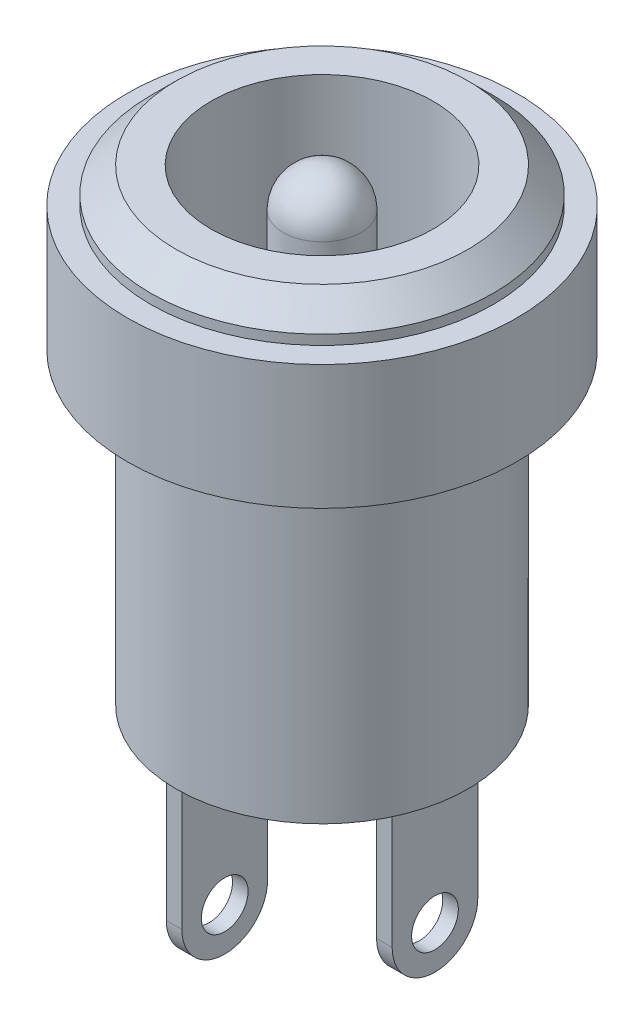
ISO-10303-21;
HEADER;
FILE_DESCRIPTION(('STEP AP214'),'2;1');
FILE_NAME('part.step','',(''),(''),'','','');
FILE_SCHEMA(('AUTOMOTIVE_DESIGN { 1 0 10303 214 1 1 1 1 }'));
ENDSEC;
DATA;
#1=APPLICATION_CONTEXT('core data for automotive mechanical design processes');
#2=APPLICATION_PROTOCOL_DEFINITION('international standard','automotive_design',2000,#1);
#3=PRODUCT_CONTEXT('',#1,'mechanical');
#4=PRODUCT('Part','Part','',(#3));
#5=PRODUCT_RELATED_PRODUCT_CATEGORY('part','',(#4));
#6=PRODUCT_DEFINITION_FORMATION('','',#4);
#7=PRODUCT_DEFINITION_CONTEXT('part definition',#1,'design');
#8=PRODUCT_DEFINITION('design','',#6,#7);
#9=PRODUCT_DEFINITION_SHAPE('','',#8);
#10=(LENGTH_UNIT() NAMED_UNIT(*) SI_UNIT(.MILLI.,.METRE.));
#11=(NAMED_UNIT(*) PLANE_ANGLE_UNIT() SI_UNIT($,.RADIAN.));
#12=(NAMED_UNIT(*) SI_UNIT($,.STERADIAN.) SOLID_ANGLE_UNIT());
#13=UNCERTAINTY_MEASURE_WITH_UNIT(LENGTH_MEASURE(1.E-05),#10,'distance_accuracy_value','');
#14=(GEOMETRIC_REPRESENTATION_CONTEXT(3) GLOBAL_UNCERTAINTY_ASSIGNED_CONTEXT((#13)) GLOBAL_UNIT_ASSIGNED_CONTEXT((#10,
#11,#12)) REPRESENTATION_CONTEXT('',''));
#15=CARTESIAN_POINT('',(0.,0.,0.));
#16=DIRECTION('',(0.,0.,1.));
#17=DIRECTION('',(1.,0.,0.));
#18=AXIS2_PLACEMENT_3D('',#15,#16,#17);
#19=CARTESIAN_POINT('',(-2.5,-12.8,1.1));
#20=DIRECTION('',(-1.,0.,0.));
#21=DIRECTION('',(0.,0.,1.));
#22=AXIS2_PLACEMENT_3D('',#19,#20,#21);
#23=PLANE('',#22);
#24=CARTESIAN_POINT('',(-2.5,-11.7,0.));
#25=DIRECTION('',(-1.,0.,0.));
#26=DIRECTION('',(0.,0.,1.));
#27=AXIS2_PLACEMENT_3D('',#24,#25,#26);
#28=CIRCLE('',#27,0.6);
#29=CARTESIAN_POINT('',(-2.5,-11.7,0.600000000000001));
#30=VERTEX_POINT('',#29);
#31=EDGE_CURVE('E611',#30,#30,#28,.F.);
#32=ORIENTED_EDGE('',*,*,#31,.F.);
#33=EDGE_LOOP('',(#32));
#34=FACE_BOUND('',#33,.T.);
#35=CARTESIAN_POINT('',(-2.5,-11.7,0.));
#36=DIRECTION('',(-1.,0.,0.));
#37=DIRECTION('',(0.,0.,1.));
#38=AXIS2_PLACEMENT_3D('',#35,#36,#37);
#39=CIRCLE('',#38,1.1);
#40=CARTESIAN_POINT('',(-2.5,-11.7,1.1));
#41=VERTEX_POINT('',#40);
#42=CARTESIAN_POINT('',(-2.5,-11.7,-1.1));
#43=VERTEX_POINT('',#42);
#44=EDGE_CURVE('E172',#41,#43,#39,.F.);
#45=ORIENTED_EDGE('',*,*,#44,.T.);
#46=DIRECTION('',(0.,1.,0.));
#47=VECTOR('',#46,1.);
#48=CARTESIAN_POINT('',(-2.5,-12.8,-1.1));
#49=LINE('',#48,#47);
#50=CARTESIAN_POINT('',(-2.5,-6.,-1.1));
#51=VERTEX_POINT('',#50);
#52=EDGE_CURVE('E179',#43,#51,#49,.T.);
#53=ORIENTED_EDGE('',*,*,#52,.T.);
#54=DIRECTION('',(0.,0.,1.));
#55=VECTOR('',#54,1.);
#56=CARTESIAN_POINT('',(-2.5,-6.,1.1));
#57=LINE('',#56,#55);
#58=CARTESIAN_POINT('',(-2.5,-6.,1.1));
#59=VERTEX_POINT('',#58);
#60=EDGE_CURVE('E248',#51,#59,#57,.T.);
#61=ORIENTED_EDGE('',*,*,#60,.T.);
#62=DIRECTION('',(0.,1.,0.));
#63=VECTOR('',#62,1.);
#64=CARTESIAN_POINT('',(-2.5,-12.8,1.1));
#65=LINE('',#64,#63);
#66=EDGE_CURVE('E188',#41,#59,#65,.T.);
#67=ORIENTED_EDGE('',*,*,#66,.F.);
#68=EDGE_LOOP('',(#45,#53,#61,#67));
#69=FACE_BOUND('',#68,.T.);
#70=ADVANCED_FACE('F96',(#34,#69),#23,.F.);
#71=CARTESIAN_POINT('',(-2.9,-12.8,1.1));
#72=DIRECTION('',(1.,0.,0.));
#73=DIRECTION('',(0.,0.,-1.));
#74=AXIS2_PLACEMENT_3D('',#71,#72,#73);
#75=PLANE('',#74);
#76=CARTESIAN_POINT('',(-2.9,-11.7,0.));
#77=DIRECTION('',(-1.,0.,0.));
#78=DIRECTION('',(0.,0.,1.));
#79=AXIS2_PLACEMENT_3D('',#76,#77,#78);
#80=CIRCLE('',#79,0.6);
#81=CARTESIAN_POINT('',(-2.9,-11.7,0.600000000000001));
#82=VERTEX_POINT('',#81);
#83=EDGE_CURVE('E180',#82,#82,#80,.T.);
#84=ORIENTED_EDGE('',*,*,#83,.F.);
#85=EDGE_LOOP('',(#84));
#86=FACE_BOUND('',#85,.T.);
#87=DIRECTION('',(0.,1.,0.));
#88=VECTOR('',#87,1.);
#89=CARTESIAN_POINT('',(-2.9,-12.8,-1.1));
#90=LINE('',#89,#88);
#91=CARTESIAN_POINT('',(-2.9,-11.7,-1.1));
#92=VERTEX_POINT('',#91);
#93=CARTESIAN_POINT('',(-2.9,-6.,-1.1));
#94=VERTEX_POINT('',#93);
#95=EDGE_CURVE('E177',#92,#94,#90,.T.);
#96=ORIENTED_EDGE('',*,*,#95,.F.);
#97=CARTESIAN_POINT('',(-2.9,-11.7,0.));
#98=DIRECTION('',(-1.,0.,0.));
#99=DIRECTION('',(0.,0.,1.));
#100=AXIS2_PLACEMENT_3D('',#97,#98,#99);
#101=CIRCLE('',#100,1.1);
#102=CARTESIAN_POINT('',(-2.9,-11.7,1.1));
#103=VERTEX_POINT('',#102);
#104=EDGE_CURVE('E162',#92,#103,#101,.T.);
#105=ORIENTED_EDGE('',*,*,#104,.T.);
#106=DIRECTION('',(0.,1.,0.));
#107=VECTOR('',#106,1.);
#108=CARTESIAN_POINT('',(-2.9,-12.8,1.1));
#109=LINE('',#108,#107);
#110=CARTESIAN_POINT('',(-2.9,-6.,1.1));
#111=VERTEX_POINT('',#110);
#112=EDGE_CURVE('E186',#103,#111,#109,.T.);
#113=ORIENTED_EDGE('',*,*,#112,.T.);
#114=DIRECTION('',(0.,0.,-1.));
#115=VECTOR('',#114,1.);
#116=CARTESIAN_POINT('',(-2.9,-6.,1.1));
#117=LINE('',#116,#115);
#118=EDGE_CURVE('E184',#111,#94,#117,.T.);
#119=ORIENTED_EDGE('',*,*,#118,.T.);
#120=EDGE_LOOP('',(#96,#105,#113,#119));
#121=FACE_BOUND('',#120,.T.);
#122=ADVANCED_FACE('F182',(#86,#121),#75,.F.);
#123=CARTESIAN_POINT('',(-2.9,-12.8,1.1));
#124=DIRECTION('',(0.,0.,-1.));
#125=DIRECTION('',(-1.,0.,0.));
#126=AXIS2_PLACEMENT_3D('',#123,#124,#125);
#127=PLANE('',#126);
#128=DIRECTION('',(-1.,0.,0.));
#129=VECTOR('',#128,1.);
#130=CARTESIAN_POINT('',(5.001,-11.7,1.1));
#131=LINE('',#130,#129);
#132=EDGE_CURVE('E168',#41,#103,#131,.T.);
#133=ORIENTED_EDGE('',*,*,#132,.F.);
#134=ORIENTED_EDGE('',*,*,#66,.T.);
#135=DIRECTION('',(-1.,0.,0.));
#136=VECTOR('',#135,1.);
#137=CARTESIAN_POINT('',(-2.9,-6.,1.1));
#138=LINE('',#137,#136);
#139=EDGE_CURVE('E235',#59,#111,#138,.T.);
#140=ORIENTED_EDGE('',*,*,#139,.T.);
#141=ORIENTED_EDGE('',*,*,#112,.F.);
#142=EDGE_LOOP('',(#133,#134,#140,#141));
#143=FACE_BOUND('',#142,.T.);
#144=ADVANCED_FACE('F300',(#143),#127,.F.);
#145=CARTESIAN_POINT('',(2.9,-12.8,1.1));
#146=DIRECTION('',(-1.,0.,0.));
#147=DIRECTION('',(0.,0.,1.));
#148=AXIS2_PLACEMENT_3D('',#145,#146,#147);
#149=PLANE('',#148);
#150=CARTESIAN_POINT('',(2.9,-9.4,0.));
#151=DIRECTION('',(1.,0.,0.));
#152=DIRECTION('',(0.,0.,-1.));
#153=AXIS2_PLACEMENT_3D('',#150,#151,#152);
#154=CIRCLE('',#153,0.6);
#155=CARTESIAN_POINT('',(2.9,-9.4,-0.599999999999999));
#156=VERTEX_POINT('',#155);
#157=EDGE_CURVE('E263',#156,#156,#154,.T.);
#158=ORIENTED_EDGE('',*,*,#157,.F.);
#159=EDGE_LOOP('',(#158));
#160=FACE_BOUND('',#159,.T.);
#161=CARTESIAN_POINT('',(2.9,-9.4,0.));
#162=DIRECTION('',(1.,0.,0.));
#163=DIRECTION('',(0.,0.,-1.));
#164=AXIS2_PLACEMENT_3D('',#161,#162,#163);
#165=CIRCLE('',#164,1.1);
#166=CARTESIAN_POINT('',(2.9,-9.4,1.1));
#167=VERTEX_POINT('',#166);
#168=CARTESIAN_POINT('',(2.9,-9.4,-1.1));
#169=VERTEX_POINT('',#168);
#170=EDGE_CURVE('E270',#167,#169,#165,.T.);
#171=ORIENTED_EDGE('',*,*,#170,.T.);
#172=DIRECTION('',(0.,1.,0.));
#173=VECTOR('',#172,1.);
#174=CARTESIAN_POINT('',(2.9,-12.8,-1.1));
#175=LINE('',#174,#173);
#176=CARTESIAN_POINT('',(2.9,-6.,-1.1));
#177=VERTEX_POINT('',#176);
#178=EDGE_CURVE('E283',#169,#177,#175,.T.);
#179=ORIENTED_EDGE('',*,*,#178,.T.);
#180=DIRECTION('',(0.,0.,1.));
#181=VECTOR('',#180,1.);
#182=CARTESIAN_POINT('',(2.9,-6.,1.1));
#183=LINE('',#182,#181);
#184=CARTESIAN_POINT('',(2.9,-6.,1.1));
#185=VERTEX_POINT('',#184);
#186=EDGE_CURVE('E243',#177,#185,#183,.T.);
#187=ORIENTED_EDGE('',*,*,#186,.T.);
#188=DIRECTION('',(0.,1.,0.));
#189=VECTOR('',#188,1.);
#190=CARTESIAN_POINT('',(2.9,-12.8,1.1));
#191=LINE('',#190,#189);
#192=EDGE_CURVE('E273',#167,#185,#191,.T.);
#193=ORIENTED_EDGE('',*,*,#192,.F.);
#194=EDGE_LOOP('',(#171,#179,#187,#193));
#195=FACE_BOUND('',#194,.T.);
#196=ADVANCED_FACE('F286',(#160,#195),#149,.F.);
#197=CARTESIAN_POINT('',(2.5,-12.8,1.1));
#198=DIRECTION('',(1.,0.,0.));
#199=DIRECTION('',(0.,0.,-1.));
#200=AXIS2_PLACEMENT_3D('',#197,#198,#199);
#201=PLANE('',#200);
#202=CARTESIAN_POINT('',(2.5,-9.4,0.));
#203=DIRECTION('',(1.,0.,0.));
#204=DIRECTION('',(0.,0.,-1.));
#205=AXIS2_PLACEMENT_3D('',#202,#203,#204);
#206=CIRCLE('',#205,0.6);
#207=CARTESIAN_POINT('',(2.5,-9.4,-0.599999999999999));
#208=VERTEX_POINT('',#207);
#209=EDGE_CURVE('E266',#208,#208,#206,.F.);
#210=ORIENTED_EDGE('',*,*,#209,.F.);
#211=EDGE_LOOP('',(#210));
#212=FACE_BOUND('',#211,.T.);
#213=CARTESIAN_POINT('',(2.5,-9.4,0.));
#214=DIRECTION('',(1.,0.,0.));
#215=DIRECTION('',(0.,0.,-1.));
#216=AXIS2_PLACEMENT_3D('',#213,#214,#215);
#217=CIRCLE('',#216,1.1);
#218=CARTESIAN_POINT('',(2.5,-9.4,-1.1));
#219=VERTEX_POINT('',#218);
#220=CARTESIAN_POINT('',(2.5,-9.4,1.1));
#221=VERTEX_POINT('',#220);
#222=EDGE_CURVE('E111',#219,#221,#217,.F.);
#223=ORIENTED_EDGE('',*,*,#222,.T.);
#224=DIRECTION('',(0.,1.,0.));
#225=VECTOR('',#224,1.);
#226=CARTESIAN_POINT('',(2.5,-12.8,1.1));
#227=LINE('',#226,#225);
#228=CARTESIAN_POINT('',(2.5,-6.,1.1));
#229=VERTEX_POINT('',#228);
#230=EDGE_CURVE('E280',#221,#229,#227,.T.);
#231=ORIENTED_EDGE('',*,*,#230,.T.);
#232=DIRECTION('',(0.,0.,-1.));
#233=VECTOR('',#232,1.);
#234=CARTESIAN_POINT('',(2.5,-6.,1.1));
#235=LINE('',#234,#233);
#236=CARTESIAN_POINT('',(2.5,-6.,-1.1));
#237=VERTEX_POINT('',#236);
#238=EDGE_CURVE('E244',#229,#237,#235,.T.);
#239=ORIENTED_EDGE('',*,*,#238,.T.);
#240=DIRECTION('',(0.,1.,0.));
#241=VECTOR('',#240,1.);
#242=CARTESIAN_POINT('',(2.5,-12.8,-1.1));
#243=LINE('',#242,#241);
#244=EDGE_CURVE('E118',#219,#237,#243,.T.);
#245=ORIENTED_EDGE('',*,*,#244,.F.);
#246=EDGE_LOOP('',(#223,#231,#239,#245));
#247=FACE_BOUND('',#246,.T.);
#248=ADVANCED_FACE('F291',(#212,#247),#201,.F.);
#249=CARTESIAN_POINT('',(2.5,-12.8,-1.1));
#250=DIRECTION('',(0.,0.,1.));
#251=DIRECTION('',(1.,0.,0.));
#252=AXIS2_PLACEMENT_3D('',#249,#250,#251);
#253=PLANE('',#252);
#254=DIRECTION('',(1.,0.,0.));
#255=VECTOR('',#254,1.);
#256=CARTESIAN_POINT('',(-5.001,-9.4,-1.1));
#257=LINE('',#256,#255);
#258=EDGE_CURVE('E269',#219,#169,#257,.T.);
#259=ORIENTED_EDGE('',*,*,#258,.F.);
#260=ORIENTED_EDGE('',*,*,#244,.T.);
#261=DIRECTION('',(1.,0.,0.));
#262=VECTOR('',#261,1.);
#263=CARTESIAN_POINT('',(2.5,-6.,-1.1));
#264=LINE('',#263,#262);
#265=EDGE_CURVE('E250',#237,#177,#264,.T.);
#266=ORIENTED_EDGE('',*,*,#265,.T.);
#267=ORIENTED_EDGE('',*,*,#178,.F.);
#268=EDGE_LOOP('',(#259,#260,#266,#267));
#269=FACE_BOUND('',#268,.T.);
#270=ADVANCED_FACE('F230',(#269),#253,.F.);
#271=CARTESIAN_POINT('',(0.,-6.,0.));
#272=DIRECTION('',(0.,-1.,0.));
#273=DIRECTION('',(0.,0.,-1.));
#274=AXIS2_PLACEMENT_3D('',#271,#272,#273);
#275=PLANE('',#274);
#276=CARTESIAN_POINT('',(0.,-6.,0.));
#277=DIRECTION('',(0.,1.,0.));
#278=DIRECTION('',(0.,0.,1.));
#279=AXIS2_PLACEMENT_3D('',#276,#277,#278);
#280=CIRCLE('',#279,3.75);
#281=CARTESIAN_POINT('',(0.,-6.,3.75));
#282=VERTEX_POINT('',#281);
#283=EDGE_CURVE('E104',#282,#282,#280,.T.);
#284=ORIENTED_EDGE('',*,*,#283,.F.);
#285=EDGE_LOOP('',(#284));
#286=FACE_BOUND('',#285,.T.);
#287=ORIENTED_EDGE('',*,*,#139,.F.);
#288=ORIENTED_EDGE('',*,*,#60,.F.);
#289=DIRECTION('',(1.,0.,0.));
#290=VECTOR('',#289,1.);
#291=CARTESIAN_POINT('',(-2.9,-6.,-1.1));
#292=LINE('',#291,#290);
#293=EDGE_CURVE('E190',#94,#51,#292,.T.);
#294=ORIENTED_EDGE('',*,*,#293,.F.);
#295=ORIENTED_EDGE('',*,*,#118,.F.);
#296=EDGE_LOOP('',(#287,#288,#294,#295));
#297=FACE_BOUND('',#296,.T.);
#298=DIRECTION('',(-1.,0.,0.));
#299=VECTOR('',#298,1.);
#300=CARTESIAN_POINT('',(2.5,-6.,1.1));
#301=LINE('',#300,#299);
#302=EDGE_CURVE('E240',#185,#229,#301,.T.);
#303=ORIENTED_EDGE('',*,*,#302,.F.);
#304=ORIENTED_EDGE('',*,*,#186,.F.);
#305=ORIENTED_EDGE('',*,*,#265,.F.);
#306=ORIENTED_EDGE('',*,*,#238,.F.);
#307=EDGE_LOOP('',(#303,#304,#305,#306));
#308=FACE_BOUND('',#307,.T.);
#309=ADVANCED_FACE('F227',(#286,#297,#308),#275,.T.);
#310=CARTESIAN_POINT('',(0.,6.,0.));
#311=DIRECTION('',(0.,1.,0.));
#312=DIRECTION('',(0.,0.,1.));
#313=AXIS2_PLACEMENT_3D('',#310,#311,#312);
#314=CYLINDRICAL_SURFACE('',#313,3.75);
#315=ORIENTED_EDGE('',*,*,#283,.T.);
#316=EDGE_LOOP('',(#315));
#317=FACE_BOUND('',#316,.T.);
#318=CARTESIAN_POINT('',(0.,1.9,0.));
#319=DIRECTION('',(0.,1.,0.));
#320=DIRECTION('',(0.,0.,1.));
#321=AXIS2_PLACEMENT_3D('',#318,#319,#320);
#322=CIRCLE('',#321,3.75);
#323=CARTESIAN_POINT('',(0.,1.9,3.75));
#324=VERTEX_POINT('',#323);
#325=EDGE_CURVE('E219',#324,#324,#322,.T.);
#326=ORIENTED_EDGE('',*,*,#325,.F.);
#327=EDGE_LOOP('',(#326));
#328=FACE_BOUND('',#327,.T.);
#329=ADVANCED_FACE('F224',(#317,#328),#314,.T.);
#330=CARTESIAN_POINT('',(-3.75,1.9,0.));
#331=DIRECTION('',(0.,-1.,0.));
#332=DIRECTION('',(0.,0.,-1.));
#333=AXIS2_PLACEMENT_3D('',#330,#331,#332);
#334=PLANE('',#333);
#335=ORIENTED_EDGE('',*,*,#325,.T.);
#336=EDGE_LOOP('',(#335));
#337=FACE_BOUND('',#336,.T.);
#338=CARTESIAN_POINT('',(0.,1.9,0.));
#339=DIRECTION('',(0.,1.,0.));
#340=DIRECTION('',(0.,0.,1.));
#341=AXIS2_PLACEMENT_3D('',#338,#339,#340);
#342=CIRCLE('',#341,5.);
#343=CARTESIAN_POINT('',(0.,1.9,5.));
#344=VERTEX_POINT('',#343);
#345=EDGE_CURVE('E216',#344,#344,#342,.T.);
#346=ORIENTED_EDGE('',*,*,#345,.F.);
#347=EDGE_LOOP('',(#346));
#348=FACE_BOUND('',#347,.T.);
#349=ADVANCED_FACE('F347',(#337,#348),#334,.T.);
#350=CARTESIAN_POINT('',(0.,6.,0.));
#351=DIRECTION('',(0.,1.,0.));
#352=DIRECTION('',(0.,0.,1.));
#353=AXIS2_PLACEMENT_3D('',#350,#351,#352);
#354=CYLINDRICAL_SURFACE('',#353,5.);
#355=ORIENTED_EDGE('',*,*,#345,.T.);
#356=EDGE_LOOP('',(#355));
#357=FACE_BOUND('',#356,.T.);
#358=CARTESIAN_POINT('',(0.,5.1,0.));
#359=DIRECTION('',(0.,1.,0.));
#360=DIRECTION('',(0.,0.,1.));
#361=AXIS2_PLACEMENT_3D('',#358,#359,#360);
#362=CIRCLE('',#361,5.);
#363=CARTESIAN_POINT('',(0.,5.1,5.));
#364=VERTEX_POINT('',#363);
#365=EDGE_CURVE('E213',#364,#364,#362,.T.);
#366=ORIENTED_EDGE('',*,*,#365,.F.);
#367=EDGE_LOOP('',(#366));
#368=FACE_BOUND('',#367,.T.);
#369=ADVANCED_FACE('F343',(#357,#368),#354,.T.);
#370=CARTESIAN_POINT('',(-5.,5.1,0.));
#371=DIRECTION('',(0.,1.,0.));
#372=DIRECTION('',(0.,0.,1.));
#373=AXIS2_PLACEMENT_3D('',#370,#371,#372);
#374=PLANE('',#373);
#375=ORIENTED_EDGE('',*,*,#365,.T.);
#376=EDGE_LOOP('',(#375));
#377=FACE_BOUND('',#376,.T.);
#378=CARTESIAN_POINT('',(0.,5.1,0.));
#379=DIRECTION('',(0.,1.,0.));
#380=DIRECTION('',(0.,0.,1.));
#381=AXIS2_PLACEMENT_3D('',#378,#379,#380);
#382=CIRCLE('',#381,4.4);
#383=CARTESIAN_POINT('',(0.,5.1,4.4));
#384=VERTEX_POINT('',#383);
#385=EDGE_CURVE('E210',#384,#384,#382,.T.);
#386=ORIENTED_EDGE('',*,*,#385,.F.);
#387=EDGE_LOOP('',(#386));
#388=FACE_BOUND('',#387,.T.);
#389=ADVANCED_FACE('F339',(#377,#388),#374,.T.);
#390=CARTESIAN_POINT('',(0.,6.,0.));
#391=DIRECTION('',(0.,1.,0.));
#392=DIRECTION('',(0.,0.,1.));
#393=AXIS2_PLACEMENT_3D('',#390,#391,#392);
#394=CYLINDRICAL_SURFACE('',#393,4.4);
#395=ORIENTED_EDGE('',*,*,#385,.T.);
#396=EDGE_LOOP('',(#395));
#397=FACE_BOUND('',#396,.T.);
#398=CARTESIAN_POINT('',(0.,5.35,0.));
#399=DIRECTION('',(0.,1.,0.));
#400=DIRECTION('',(0.,0.,1.));
#401=AXIS2_PLACEMENT_3D('',#398,#399,#400);
#402=CIRCLE('',#401,4.4);
#403=CARTESIAN_POINT('',(0.,5.35,4.4));
#404=VERTEX_POINT('',#403);
#405=EDGE_CURVE('E207',#404,#404,#402,.T.);
#406=ORIENTED_EDGE('',*,*,#405,.F.);
#407=EDGE_LOOP('',(#406));
#408=FACE_BOUND('',#407,.T.);
#409=ADVANCED_FACE('F335',(#397,#408),#394,.T.);
#410=CARTESIAN_POINT('',(0.,6.,0.));
#411=DIRECTION('',(0.,-1.,0.));
#412=DIRECTION('',(0.,0.,-1.));
#413=AXIS2_PLACEMENT_3D('',#410,#411,#412);
#414=CONICAL_SURFACE('',#413,3.75,0.785398163397451);
#415=ORIENTED_EDGE('',*,*,#405,.T.);
#416=EDGE_LOOP('',(#415));
#417=FACE_BOUND('',#416,.T.);
#418=CARTESIAN_POINT('',(0.,6.,0.));
#419=DIRECTION('',(0.,1.,0.));
#420=DIRECTION('',(0.,0.,1.));
#421=AXIS2_PLACEMENT_3D('',#418,#419,#420);
#422=CIRCLE('',#421,3.75);
#423=CARTESIAN_POINT('',(0.,6.,3.75));
#424=VERTEX_POINT('',#423);
#425=EDGE_CURVE('E202',#424,#424,#422,.T.);
#426=ORIENTED_EDGE('',*,*,#425,.F.);
#427=EDGE_LOOP('',(#426));
#428=FACE_BOUND('',#427,.T.);
#429=ADVANCED_FACE('F331',(#417,#428),#414,.T.);
#430=CARTESIAN_POINT('',(0.,6.,0.));
#431=DIRECTION('',(0.,1.,0.));
#432=DIRECTION('',(0.,0.,1.));
#433=AXIS2_PLACEMENT_3D('',#430,#431,#432);
#434=PLANE('',#433);
#435=CARTESIAN_POINT('',(0.,6.,0.));
#436=DIRECTION('',(0.,1.,0.));
#437=DIRECTION('',(0.,0.,1.));
#438=AXIS2_PLACEMENT_3D('',#435,#436,#437);
#439=CIRCLE('',#438,2.85);
#440=CARTESIAN_POINT('',(0.,6.,2.85));
#441=VERTEX_POINT('',#440);
#442=EDGE_CURVE('E198',#441,#441,#439,.T.);
#443=ORIENTED_EDGE('',*,*,#442,.F.);
#444=EDGE_LOOP('',(#443));
#445=FACE_BOUND('',#444,.T.);
#446=ORIENTED_EDGE('',*,*,#425,.T.);
#447=EDGE_LOOP('',(#446));
#448=FACE_BOUND('',#447,.T.);
#449=ADVANCED_FACE('F327',(#445,#448),#434,.T.);
#450=CARTESIAN_POINT('',(0.,-4.,0.));
#451=DIRECTION('',(0.,1.,0.));
#452=DIRECTION('',(0.,0.,1.));
#453=AXIS2_PLACEMENT_3D('',#450,#451,#452);
#454=CYLINDRICAL_SURFACE('',#453,2.85);
#455=CARTESIAN_POINT('',(0.,-4.,0.));
#456=DIRECTION('',(0.,1.,0.));
#457=DIRECTION('',(0.,0.,1.));
#458=AXIS2_PLACEMENT_3D('',#455,#456,#457);
#459=CIRCLE('',#458,2.85);
#460=CARTESIAN_POINT('',(0.,-4.,2.85));
#461=VERTEX_POINT('',#460);
#462=EDGE_CURVE('E199',#461,#461,#459,.T.);
#463=ORIENTED_EDGE('',*,*,#462,.F.);
#464=EDGE_LOOP('',(#463));
#465=FACE_BOUND('',#464,.T.);
#466=ORIENTED_EDGE('',*,*,#442,.T.);
#467=EDGE_LOOP('',(#466));
#468=FACE_BOUND('',#467,.T.);
#469=ADVANCED_FACE('F323',(#465,#468),#454,.F.);
#470=CARTESIAN_POINT('',(0.,-4.,0.));
#471=DIRECTION('',(0.,1.,0.));
#472=DIRECTION('',(0.,0.,1.));
#473=AXIS2_PLACEMENT_3D('',#470,#471,#472);
#474=PLANE('',#473);
#475=CARTESIAN_POINT('',(0.,-4.,0.));
#476=DIRECTION('',(0.,1.,0.));
#477=DIRECTION('',(0.,0.,1.));
#478=AXIS2_PLACEMENT_3D('',#475,#476,#477);
#479=CIRCLE('',#478,1.);
#480=CARTESIAN_POINT('',(0.,-4.,1.));
#481=VERTEX_POINT('',#480);
#482=EDGE_CURVE('E195',#481,#481,#479,.T.);
#483=ORIENTED_EDGE('',*,*,#482,.F.);
#484=EDGE_LOOP('',(#483));
#485=FACE_BOUND('',#484,.T.);
#486=ORIENTED_EDGE('',*,*,#462,.T.);
#487=EDGE_LOOP('',(#486));
#488=FACE_BOUND('',#487,.T.);
#489=ADVANCED_FACE('F319',(#485,#488),#474,.T.);
#490=CARTESIAN_POINT('',(0.,-4.,0.));
#491=DIRECTION('',(0.,1.,0.));
#492=DIRECTION('',(0.,0.,1.));
#493=AXIS2_PLACEMENT_3D('',#490,#491,#492);
#494=CYLINDRICAL_SURFACE('',#493,1.);
#495=CARTESIAN_POINT('',(0.,5.,0.));
#496=DIRECTION('',(0.,1.,0.));
#497=DIRECTION('',(0.,0.,1.));
#498=AXIS2_PLACEMENT_3D('',#495,#496,#497);
#499=CIRCLE('',#498,1.);
#500=CARTESIAN_POINT('',(0.,5.,1.));
#501=VERTEX_POINT('',#500);
#502=EDGE_CURVE('E12',#501,#501,#499,.F.);
#503=ORIENTED_EDGE('',*,*,#502,.T.);
#504=EDGE_LOOP('',(#503));
#505=FACE_BOUND('',#504,.T.);
#506=ORIENTED_EDGE('',*,*,#482,.T.);
#507=EDGE_LOOP('',(#506));
#508=FACE_BOUND('',#507,.T.);
#509=ADVANCED_FACE('F316',(#505,#508),#494,.T.);
#510=CARTESIAN_POINT('',(0.,5.,0.));
#511=DIRECTION('',(0.,1.,0.));
#512=DIRECTION('',(0.,0.,1.));
#513=AXIS2_PLACEMENT_3D('',#510,#511,#512);
#514=SPHERICAL_SURFACE('',#513,1.);
#515=ORIENTED_EDGE('',*,*,#502,.F.);
#516=EDGE_LOOP('',(#515));
#517=FACE_BOUND('',#516,.T.);
#518=ADVANCED_FACE('F98',(#517),#514,.T.);
#519=CARTESIAN_POINT('',(-2.9,-12.8,-1.1));
#520=DIRECTION('',(0.,0.,1.));
#521=DIRECTION('',(1.,0.,0.));
#522=AXIS2_PLACEMENT_3D('',#519,#520,#521);
#523=PLANE('',#522);
#524=ORIENTED_EDGE('',*,*,#52,.F.);
#525=DIRECTION('',(-1.,0.,0.));
#526=VECTOR('',#525,1.);
#527=CARTESIAN_POINT('',(5.001,-11.7,-1.1));
#528=LINE('',#527,#526);
#529=EDGE_CURVE('E165',#43,#92,#528,.T.);
#530=ORIENTED_EDGE('',*,*,#529,.T.);
#531=ORIENTED_EDGE('',*,*,#95,.T.);
#532=ORIENTED_EDGE('',*,*,#293,.T.);
#533=EDGE_LOOP('',(#524,#530,#531,#532));
#534=FACE_BOUND('',#533,.T.);
#535=ADVANCED_FACE('F175',(#534),#523,.F.);
#536=CARTESIAN_POINT('',(2.5,-12.8,1.1));
#537=DIRECTION('',(0.,0.,-1.));
#538=DIRECTION('',(-1.,0.,0.));
#539=AXIS2_PLACEMENT_3D('',#536,#537,#538);
#540=PLANE('',#539);
#541=ORIENTED_EDGE('',*,*,#230,.F.);
#542=DIRECTION('',(1.,0.,0.));
#543=VECTOR('',#542,1.);
#544=CARTESIAN_POINT('',(-5.001,-9.4,1.1));
#545=LINE('',#544,#543);
#546=EDGE_CURVE('E274',#221,#167,#545,.T.);
#547=ORIENTED_EDGE('',*,*,#546,.T.);
#548=ORIENTED_EDGE('',*,*,#192,.T.);
#549=ORIENTED_EDGE('',*,*,#302,.T.);
#550=EDGE_LOOP('',(#541,#547,#548,#549));
#551=FACE_BOUND('',#550,.T.);
#552=ADVANCED_FACE('F289',(#551),#540,.F.);
#553=CARTESIAN_POINT('',(-5.001,-9.4,0.));
#554=DIRECTION('',(1.,0.,0.));
#555=DIRECTION('',(0.,0.,-1.));
#556=AXIS2_PLACEMENT_3D('',#553,#554,#555);
#557=CYLINDRICAL_SURFACE('',#556,1.1);
#558=ORIENTED_EDGE('',*,*,#258,.T.);
#559=ORIENTED_EDGE('',*,*,#170,.F.);
#560=ORIENTED_EDGE('',*,*,#546,.F.);
#561=ORIENTED_EDGE('',*,*,#222,.F.);
#562=EDGE_LOOP('',(#558,#559,#560,#561));
#563=FACE_BOUND('',#562,.T.);
#564=ADVANCED_FACE('F288',(#563),#557,.T.);
#565=CARTESIAN_POINT('',(-5.001,-9.4,0.));
#566=DIRECTION('',(1.,0.,0.));
#567=DIRECTION('',(0.,0.,-1.));
#568=AXIS2_PLACEMENT_3D('',#565,#566,#567);
#569=CYLINDRICAL_SURFACE('',#568,0.6);
#570=ORIENTED_EDGE('',*,*,#157,.T.);
#571=EDGE_LOOP('',(#570));
#572=FACE_BOUND('',#571,.T.);
#573=ORIENTED_EDGE('',*,*,#209,.T.);
#574=EDGE_LOOP('',(#573));
#575=FACE_BOUND('',#574,.T.);
#576=ADVANCED_FACE('F420',(#572,#575),#569,.F.);
#577=CARTESIAN_POINT('',(5.001,-11.7,0.));
#578=DIRECTION('',(-1.,0.,0.));
#579=DIRECTION('',(0.,0.,1.));
#580=AXIS2_PLACEMENT_3D('',#577,#578,#579);
#581=CYLINDRICAL_SURFACE('',#580,1.1);
#582=ORIENTED_EDGE('',*,*,#132,.T.);
#583=ORIENTED_EDGE('',*,*,#104,.F.);
#584=ORIENTED_EDGE('',*,*,#529,.F.);
#585=ORIENTED_EDGE('',*,*,#44,.F.);
#586=EDGE_LOOP('',(#582,#583,#584,#585));
#587=FACE_BOUND('',#586,.T.);
#588=ADVANCED_FACE('F164',(#587),#581,.T.);
#589=CARTESIAN_POINT('',(5.001,-11.7,0.));
#590=DIRECTION('',(-1.,0.,0.));
#591=DIRECTION('',(0.,0.,1.));
#592=AXIS2_PLACEMENT_3D('',#589,#590,#591);
#593=CYLINDRICAL_SURFACE('',#592,0.6);
#594=ORIENTED_EDGE('',*,*,#83,.T.);
#595=EDGE_LOOP('',(#594));
#596=FACE_BOUND('',#595,.T.);
#597=ORIENTED_EDGE('',*,*,#31,.T.);
#598=EDGE_LOOP('',(#597));
#599=FACE_BOUND('',#598,.T.);
#600=ADVANCED_FACE('F433',(#596,#599),#593,.F.);
#601=CLOSED_SHELL('',(#70,#122,#144,#196,#248,#270,#309,#329,#349,#369,#389,#409,#429,#449,#469,
#489,#509,#518,#535,#552,#564,#576,#588,#600));
#602=MANIFOLD_SOLID_BREP('B2',#601);
#603=ADVANCED_BREP_SHAPE_REPRESENTATION('',(#18,#602),#14);
#604=SHAPE_DEFINITION_REPRESENTATION(#9,#603);
ENDSEC;
END-ISO-10303-21;
